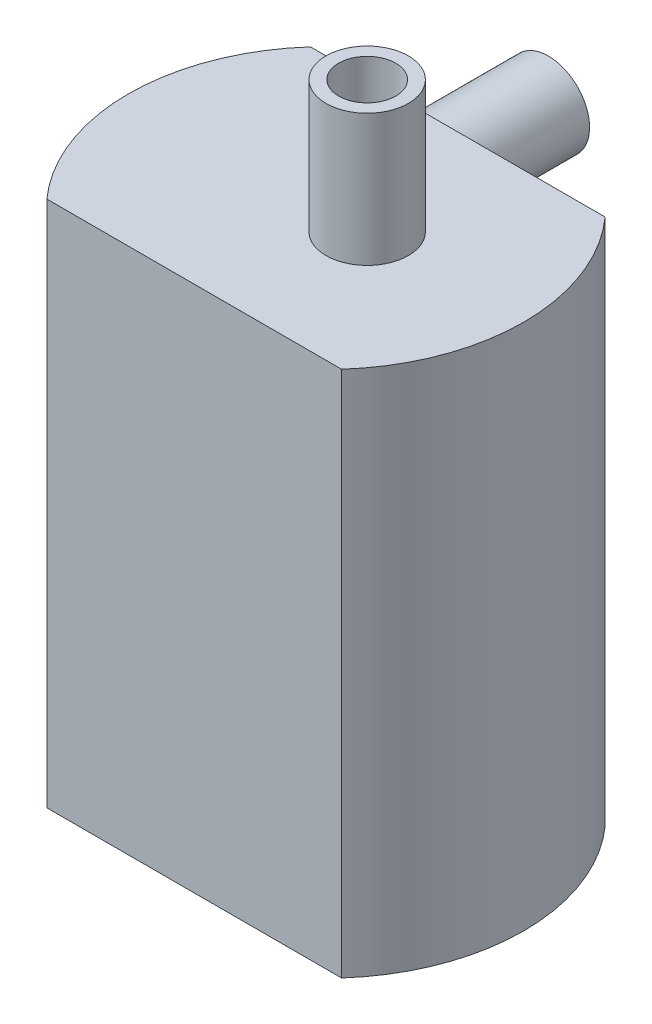
ISO-10303-21;
HEADER;
FILE_DESCRIPTION(('STEP AP214'),'2;1');
FILE_NAME('part.step','',(''),(''),'','','');
FILE_SCHEMA(('AUTOMOTIVE_DESIGN { 1 0 10303 214 1 1 1 1 }'));
ENDSEC;
DATA;
#1=APPLICATION_CONTEXT('core data for automotive mechanical design processes');
#2=APPLICATION_PROTOCOL_DEFINITION('international standard','automotive_design',2000,#1);
#3=PRODUCT_CONTEXT('',#1,'mechanical');
#4=PRODUCT('Part','Part','',(#3));
#5=PRODUCT_RELATED_PRODUCT_CATEGORY('part','',(#4));
#6=PRODUCT_DEFINITION_FORMATION('','',#4);
#7=PRODUCT_DEFINITION_CONTEXT('part definition',#1,'design');
#8=PRODUCT_DEFINITION('design','',#6,#7);
#9=PRODUCT_DEFINITION_SHAPE('','',#8);
#10=(LENGTH_UNIT() NAMED_UNIT(*) SI_UNIT(.MILLI.,.METRE.));
#11=(NAMED_UNIT(*) PLANE_ANGLE_UNIT() SI_UNIT($,.RADIAN.));
#12=(NAMED_UNIT(*) SI_UNIT($,.STERADIAN.) SOLID_ANGLE_UNIT());
#13=UNCERTAINTY_MEASURE_WITH_UNIT(LENGTH_MEASURE(1.E-05),#10,'distance_accuracy_value','');
#14=(GEOMETRIC_REPRESENTATION_CONTEXT(3) GLOBAL_UNCERTAINTY_ASSIGNED_CONTEXT((#13)) GLOBAL_UNIT_ASSIGNED_CONTEXT((#10,
#11,#12)) REPRESENTATION_CONTEXT('',''));
#15=CARTESIAN_POINT('',(0.,0.,0.));
#16=DIRECTION('',(0.,0.,1.));
#17=DIRECTION('',(1.,0.,0.));
#18=AXIS2_PLACEMENT_3D('',#15,#16,#17);
#19=CARTESIAN_POINT('',(0.,50.8,12.7));
#20=DIRECTION('',(0.,0.,-1.));
#21=DIRECTION('',(-1.,0.,0.));
#22=AXIS2_PLACEMENT_3D('',#19,#20,#21);
#23=PLANE('',#22);
#24=DIRECTION('',(1.,0.,0.));
#25=VECTOR('',#24,1.);
#26=CARTESIAN_POINT('',(0.,0.,12.7));
#27=LINE('',#26,#25);
#28=CARTESIAN_POINT('',(-14.1990316571237,0.,12.7));
#29=VERTEX_POINT('',#28);
#30=CARTESIAN_POINT('',(14.1990316571237,0.,12.7));
#31=VERTEX_POINT('',#30);
#32=EDGE_CURVE('E100',#29,#31,#27,.T.);
#33=ORIENTED_EDGE('',*,*,#32,.T.);
#34=DIRECTION('',(0.,-1.,0.));
#35=VECTOR('',#34,1.);
#36=CARTESIAN_POINT('',(14.1990316571237,50.8,12.7));
#37=LINE('',#36,#35);
#38=CARTESIAN_POINT('',(14.1990316571237,50.8,12.7));
#39=VERTEX_POINT('',#38);
#40=EDGE_CURVE('E93',#39,#31,#37,.T.);
#41=ORIENTED_EDGE('',*,*,#40,.F.);
#42=DIRECTION('',(1.,0.,0.));
#43=VECTOR('',#42,1.);
#44=CARTESIAN_POINT('',(0.,50.8,12.7));
#45=LINE('',#44,#43);
#46=CARTESIAN_POINT('',(-14.1990316571237,50.8,12.7));
#47=VERTEX_POINT('',#46);
#48=EDGE_CURVE('E83',#47,#39,#45,.T.);
#49=ORIENTED_EDGE('',*,*,#48,.F.);
#50=DIRECTION('',(0.,-1.,0.));
#51=VECTOR('',#50,1.);
#52=CARTESIAN_POINT('',(-14.1990316571237,50.8,12.7));
#53=LINE('',#52,#51);
#54=EDGE_CURVE('E97',#47,#29,#53,.T.);
#55=ORIENTED_EDGE('',*,*,#54,.T.);
#56=EDGE_LOOP('',(#33,#41,#49,#55));
#57=FACE_BOUND('',#56,.T.);
#58=ADVANCED_FACE('F35',(#57),#23,.F.);
#59=CARTESIAN_POINT('',(0.,50.8,0.));
#60=DIRECTION('',(0.,-1.,0.));
#61=DIRECTION('',(0.,0.,-1.));
#62=AXIS2_PLACEMENT_3D('',#59,#60,#61);
#63=CYLINDRICAL_SURFACE('',#62,19.05);
#64=CARTESIAN_POINT('',(0.,0.,0.));
#65=DIRECTION('',(0.,1.,0.));
#66=DIRECTION('',(0.,0.,1.));
#67=AXIS2_PLACEMENT_3D('',#64,#65,#66);
#68=CIRCLE('',#67,19.05);
#69=CARTESIAN_POINT('',(14.1990316571237,0.,-12.7));
#70=VERTEX_POINT('',#69);
#71=EDGE_CURVE('E89',#31,#70,#68,.T.);
#72=ORIENTED_EDGE('',*,*,#71,.T.);
#73=DIRECTION('',(0.,-1.,0.));
#74=VECTOR('',#73,1.);
#75=CARTESIAN_POINT('',(14.1990316571237,50.8,-12.7));
#76=LINE('',#75,#74);
#77=CARTESIAN_POINT('',(14.1990316571237,50.8,-12.7));
#78=VERTEX_POINT('',#77);
#79=EDGE_CURVE('E87',#78,#70,#76,.T.);
#80=ORIENTED_EDGE('',*,*,#79,.F.);
#81=CARTESIAN_POINT('',(0.,50.8,0.));
#82=DIRECTION('',(0.,1.,0.));
#83=DIRECTION('',(0.,0.,1.));
#84=AXIS2_PLACEMENT_3D('',#81,#82,#83);
#85=CIRCLE('',#84,19.05);
#86=EDGE_CURVE('E78',#39,#78,#85,.T.);
#87=ORIENTED_EDGE('',*,*,#86,.F.);
#88=ORIENTED_EDGE('',*,*,#40,.T.);
#89=EDGE_LOOP('',(#72,#80,#87,#88));
#90=FACE_BOUND('',#89,.T.);
#91=ADVANCED_FACE('F88',(#90),#63,.T.);
#92=CARTESIAN_POINT('',(0.,50.8,-12.7));
#93=DIRECTION('',(0.,0.,-1.));
#94=DIRECTION('',(-1.,0.,0.));
#95=AXIS2_PLACEMENT_3D('',#92,#93,#94);
#96=PLANE('',#95);
#97=CARTESIAN_POINT('',(-3.96875,44.83125,-12.7));
#98=DIRECTION('',(0.,0.,-1.));
#99=DIRECTION('',(-1.,0.,0.));
#100=AXIS2_PLACEMENT_3D('',#97,#98,#99);
#101=CIRCLE('',#100,3.96875);
#102=CARTESIAN_POINT('',(-7.9375,44.83125,-12.7));
#103=VERTEX_POINT('',#102);
#104=EDGE_CURVE('E152',#103,#103,#101,.T.);
#105=ORIENTED_EDGE('',*,*,#104,.F.);
#106=EDGE_LOOP('',(#105));
#107=FACE_BOUND('',#106,.T.);
#108=DIRECTION('',(1.,0.,0.));
#109=VECTOR('',#108,1.);
#110=CARTESIAN_POINT('',(0.,0.,-12.7));
#111=LINE('',#110,#109);
#112=CARTESIAN_POINT('',(-14.1990316571237,0.,-12.7));
#113=VERTEX_POINT('',#112);
#114=EDGE_CURVE('E105',#113,#70,#111,.T.);
#115=ORIENTED_EDGE('',*,*,#114,.F.);
#116=DIRECTION('',(0.,-1.,0.));
#117=VECTOR('',#116,1.);
#118=CARTESIAN_POINT('',(-14.1990316571237,50.8,-12.7));
#119=LINE('',#118,#117);
#120=CARTESIAN_POINT('',(-14.1990316571237,50.8,-12.7));
#121=VERTEX_POINT('',#120);
#122=EDGE_CURVE('E67',#121,#113,#119,.T.);
#123=ORIENTED_EDGE('',*,*,#122,.F.);
#124=DIRECTION('',(1.,0.,0.));
#125=VECTOR('',#124,1.);
#126=CARTESIAN_POINT('',(0.,50.8,-12.7));
#127=LINE('',#126,#125);
#128=EDGE_CURVE('E81',#121,#78,#127,.T.);
#129=ORIENTED_EDGE('',*,*,#128,.T.);
#130=ORIENTED_EDGE('',*,*,#79,.T.);
#131=EDGE_LOOP('',(#115,#123,#129,#130));
#132=FACE_BOUND('',#131,.T.);
#133=ADVANCED_FACE('F95',(#107,#132),#96,.T.);
#134=EDGE_CURVE('E70',#113,#29,#68,.T.);
#135=ORIENTED_EDGE('',*,*,#134,.T.);
#136=ORIENTED_EDGE('',*,*,#54,.F.);
#137=EDGE_CURVE('E51',#121,#47,#85,.T.);
#138=ORIENTED_EDGE('',*,*,#137,.F.);
#139=ORIENTED_EDGE('',*,*,#122,.T.);
#140=EDGE_LOOP('',(#135,#136,#138,#139));
#141=FACE_BOUND('',#140,.T.);
#142=ADVANCED_FACE('F132',(#141),#63,.T.);
#143=CARTESIAN_POINT('',(0.,50.8,0.));
#144=DIRECTION('',(0.,1.,0.));
#145=DIRECTION('',(0.,0.,1.));
#146=AXIS2_PLACEMENT_3D('',#143,#144,#145);
#147=PLANE('',#146);
#148=CARTESIAN_POINT('',(3.96875,50.8,0.));
#149=DIRECTION('',(0.,1.,0.));
#150=DIRECTION('',(0.,0.,1.));
#151=AXIS2_PLACEMENT_3D('',#148,#149,#150);
#152=CIRCLE('',#151,3.96875);
#153=CARTESIAN_POINT('',(3.96875,50.8,3.96875));
#154=VERTEX_POINT('',#153);
#155=EDGE_CURVE('E143',#154,#154,#152,.T.);
#156=ORIENTED_EDGE('',*,*,#155,.F.);
#157=EDGE_LOOP('',(#156));
#158=FACE_BOUND('',#157,.T.);
#159=ORIENTED_EDGE('',*,*,#48,.T.);
#160=ORIENTED_EDGE('',*,*,#86,.T.);
#161=ORIENTED_EDGE('',*,*,#128,.F.);
#162=ORIENTED_EDGE('',*,*,#137,.T.);
#163=EDGE_LOOP('',(#159,#160,#161,#162));
#164=FACE_BOUND('',#163,.T.);
#165=ADVANCED_FACE('F79',(#158,#164),#147,.T.);
#166=CARTESIAN_POINT('',(0.,0.,0.));
#167=DIRECTION('',(0.,1.,0.));
#168=DIRECTION('',(0.,0.,1.));
#169=AXIS2_PLACEMENT_3D('',#166,#167,#168);
#170=PLANE('',#169);
#171=ORIENTED_EDGE('',*,*,#32,.F.);
#172=ORIENTED_EDGE('',*,*,#134,.F.);
#173=ORIENTED_EDGE('',*,*,#114,.T.);
#174=ORIENTED_EDGE('',*,*,#71,.F.);
#175=EDGE_LOOP('',(#171,#172,#173,#174));
#176=FACE_BOUND('',#175,.T.);
#177=ADVANCED_FACE('F131',(#176),#170,.F.);
#178=CARTESIAN_POINT('',(3.96875,63.5,0.));
#179=DIRECTION('',(0.,1.,0.));
#180=DIRECTION('',(0.,0.,1.));
#181=AXIS2_PLACEMENT_3D('',#178,#179,#180);
#182=PLANE('',#181);
#183=CARTESIAN_POINT('',(3.96875,63.5,0.));
#184=DIRECTION('',(0.,1.,0.));
#185=DIRECTION('',(0.,0.,1.));
#186=AXIS2_PLACEMENT_3D('',#183,#184,#185);
#187=CIRCLE('',#186,3.96875);
#188=CARTESIAN_POINT('',(3.96875,63.5,3.96875));
#189=VERTEX_POINT('',#188);
#190=EDGE_CURVE('E103',#189,#189,#187,.T.);
#191=ORIENTED_EDGE('',*,*,#190,.T.);
#192=EDGE_LOOP('',(#191));
#193=FACE_BOUND('',#192,.T.);
#194=CARTESIAN_POINT('',(3.96875,63.5,0.));
#195=DIRECTION('',(0.,1.,0.));
#196=DIRECTION('',(0.,0.,1.));
#197=AXIS2_PLACEMENT_3D('',#194,#195,#196);
#198=CIRCLE('',#197,2.75);
#199=CARTESIAN_POINT('',(3.96875,63.5,2.75));
#200=VERTEX_POINT('',#199);
#201=EDGE_CURVE('E146',#200,#200,#198,.T.);
#202=ORIENTED_EDGE('',*,*,#201,.F.);
#203=EDGE_LOOP('',(#202));
#204=FACE_BOUND('',#203,.T.);
#205=ADVANCED_FACE('F186',(#193,#204),#182,.T.);
#206=CARTESIAN_POINT('',(3.96875,63.5,0.));
#207=DIRECTION('',(0.,-1.,0.));
#208=DIRECTION('',(0.,0.,-1.));
#209=AXIS2_PLACEMENT_3D('',#206,#207,#208);
#210=CYLINDRICAL_SURFACE('',#209,3.96875);
#211=ORIENTED_EDGE('',*,*,#190,.F.);
#212=EDGE_LOOP('',(#211));
#213=FACE_BOUND('',#212,.T.);
#214=ORIENTED_EDGE('',*,*,#155,.T.);
#215=EDGE_LOOP('',(#214));
#216=FACE_BOUND('',#215,.T.);
#217=ADVANCED_FACE('F125',(#213,#216),#210,.T.);
#218=CARTESIAN_POINT('',(3.96875,63.5,0.));
#219=DIRECTION('',(0.,-1.,0.));
#220=DIRECTION('',(0.,0.,-1.));
#221=AXIS2_PLACEMENT_3D('',#218,#219,#220);
#222=CYLINDRICAL_SURFACE('',#221,2.75);
#223=ORIENTED_EDGE('',*,*,#201,.T.);
#224=EDGE_LOOP('',(#223));
#225=FACE_BOUND('',#224,.T.);
#226=CARTESIAN_POINT('',(3.96875,50.8,0.));
#227=DIRECTION('',(0.,1.,0.));
#228=DIRECTION('',(0.,0.,1.));
#229=AXIS2_PLACEMENT_3D('',#226,#227,#228);
#230=CIRCLE('',#229,2.75);
#231=CARTESIAN_POINT('',(3.96875,50.8,2.75));
#232=VERTEX_POINT('',#231);
#233=EDGE_CURVE('E43',#232,#232,#230,.F.);
#234=ORIENTED_EDGE('',*,*,#233,.T.);
#235=EDGE_LOOP('',(#234));
#236=FACE_BOUND('',#235,.T.);
#237=ADVANCED_FACE('F112',(#225,#236),#222,.F.);
#238=ORIENTED_EDGE('',*,*,#233,.F.);
#239=EDGE_LOOP('',(#238));
#240=FACE_BOUND('',#239,.T.);
#241=ADVANCED_FACE('F114',(#240),#147,.T.);
#242=CARTESIAN_POINT('',(-3.96875,44.83125,-25.4));
#243=DIRECTION('',(0.,0.,-1.));
#244=DIRECTION('',(-1.,0.,0.));
#245=AXIS2_PLACEMENT_3D('',#242,#243,#244);
#246=PLANE('',#245);
#247=CARTESIAN_POINT('',(-3.96875,44.83125,-25.4));
#248=DIRECTION('',(0.,0.,-1.));
#249=DIRECTION('',(-1.,0.,0.));
#250=AXIS2_PLACEMENT_3D('',#247,#248,#249);
#251=CIRCLE('',#250,3.96875);
#252=CARTESIAN_POINT('',(-7.9375,44.83125,-25.4));
#253=VERTEX_POINT('',#252);
#254=EDGE_CURVE('E151',#253,#253,#251,.T.);
#255=ORIENTED_EDGE('',*,*,#254,.T.);
#256=EDGE_LOOP('',(#255));
#257=FACE_BOUND('',#256,.T.);
#258=CARTESIAN_POINT('',(-3.96875,44.83125,-25.4));
#259=DIRECTION('',(0.,0.,-1.));
#260=DIRECTION('',(-1.,0.,0.));
#261=AXIS2_PLACEMENT_3D('',#258,#259,#260);
#262=CIRCLE('',#261,2.75);
#263=CARTESIAN_POINT('',(-6.71875,44.83125,-25.4));
#264=VERTEX_POINT('',#263);
#265=EDGE_CURVE('E155',#264,#264,#262,.T.);
#266=ORIENTED_EDGE('',*,*,#265,.F.);
#267=EDGE_LOOP('',(#266));
#268=FACE_BOUND('',#267,.T.);
#269=ADVANCED_FACE('F116',(#257,#268),#246,.T.);
#270=CARTESIAN_POINT('',(-3.96875,44.83125,-25.4));
#271=DIRECTION('',(0.,0.,1.));
#272=DIRECTION('',(1.,0.,0.));
#273=AXIS2_PLACEMENT_3D('',#270,#271,#272);
#274=CYLINDRICAL_SURFACE('',#273,3.96875);
#275=ORIENTED_EDGE('',*,*,#254,.F.);
#276=EDGE_LOOP('',(#275));
#277=FACE_BOUND('',#276,.T.);
#278=ORIENTED_EDGE('',*,*,#104,.T.);
#279=EDGE_LOOP('',(#278));
#280=FACE_BOUND('',#279,.T.);
#281=ADVANCED_FACE('F122',(#277,#280),#274,.T.);
#282=CARTESIAN_POINT('',(-3.96875,44.83125,-25.4));
#283=DIRECTION('',(0.,0.,1.));
#284=DIRECTION('',(1.,0.,0.));
#285=AXIS2_PLACEMENT_3D('',#282,#283,#284);
#286=CYLINDRICAL_SURFACE('',#285,2.75);
#287=ORIENTED_EDGE('',*,*,#265,.T.);
#288=EDGE_LOOP('',(#287));
#289=FACE_BOUND('',#288,.T.);
#290=CARTESIAN_POINT('',(-3.96875,44.83125,-12.7));
#291=DIRECTION('',(0.,0.,-1.));
#292=DIRECTION('',(-1.,0.,0.));
#293=AXIS2_PLACEMENT_3D('',#290,#291,#292);
#294=CIRCLE('',#293,2.75);
#295=CARTESIAN_POINT('',(-6.71875,44.83125,-12.7));
#296=VERTEX_POINT('',#295);
#297=EDGE_CURVE('E11',#296,#296,#294,.F.);
#298=ORIENTED_EDGE('',*,*,#297,.T.);
#299=EDGE_LOOP('',(#298));
#300=FACE_BOUND('',#299,.T.);
#301=ADVANCED_FACE('F161',(#289,#300),#286,.F.);
#302=ORIENTED_EDGE('',*,*,#297,.F.);
#303=EDGE_LOOP('',(#302));
#304=FACE_BOUND('',#303,.T.);
#305=ADVANCED_FACE('F165',(#304),#96,.T.);
#306=CLOSED_SHELL('',(#58,#91,#133,#142,#165,#177,#205,#217,#237,#241,#269,#281,#301,#305));
#307=MANIFOLD_SOLID_BREP('B2',#306);
#308=ADVANCED_BREP_SHAPE_REPRESENTATION('',(#18,#307),#14);
#309=SHAPE_DEFINITION_REPRESENTATION(#9,#308);
ENDSEC;
END-ISO-10303-21;
